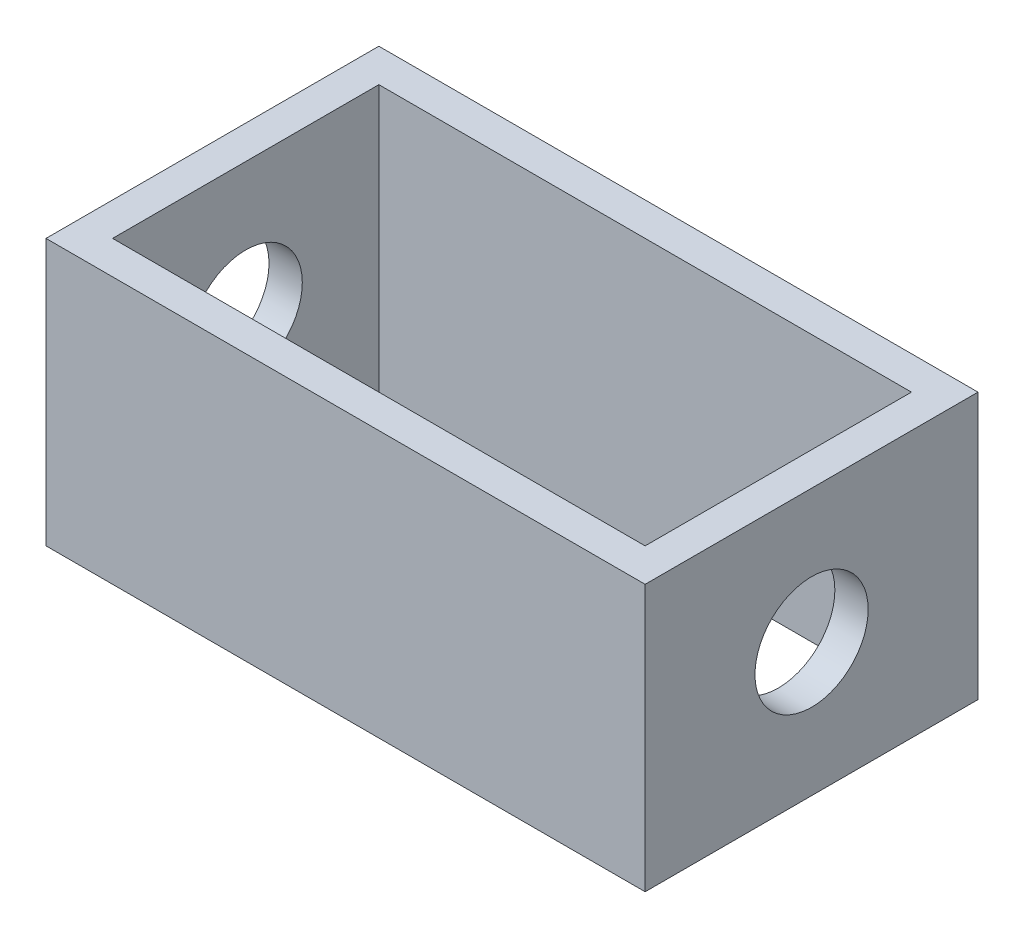
ISO-10303-21;
HEADER;
FILE_DESCRIPTION(('STEP AP214'),'2;1');
FILE_NAME('part.step','',(''),(''),'','','');
FILE_SCHEMA(('AUTOMOTIVE_DESIGN { 1 0 10303 214 1 1 1 1 }'));
ENDSEC;
DATA;
#1=APPLICATION_CONTEXT('core data for automotive mechanical design processes');
#2=APPLICATION_PROTOCOL_DEFINITION('international standard','automotive_design',2000,#1);
#3=PRODUCT_CONTEXT('',#1,'mechanical');
#4=PRODUCT('Part','Part','',(#3));
#5=PRODUCT_RELATED_PRODUCT_CATEGORY('part','',(#4));
#6=PRODUCT_DEFINITION_FORMATION('','',#4);
#7=PRODUCT_DEFINITION_CONTEXT('part definition',#1,'design');
#8=PRODUCT_DEFINITION('design','',#6,#7);
#9=PRODUCT_DEFINITION_SHAPE('','',#8);
#10=(LENGTH_UNIT() NAMED_UNIT(*) SI_UNIT(.MILLI.,.METRE.));
#11=(NAMED_UNIT(*) PLANE_ANGLE_UNIT() SI_UNIT($,.RADIAN.));
#12=(NAMED_UNIT(*) SI_UNIT($,.STERADIAN.) SOLID_ANGLE_UNIT());
#13=UNCERTAINTY_MEASURE_WITH_UNIT(LENGTH_MEASURE(1.E-05),#10,'distance_accuracy_value','');
#14=(GEOMETRIC_REPRESENTATION_CONTEXT(3) GLOBAL_UNCERTAINTY_ASSIGNED_CONTEXT((#13)) GLOBAL_UNIT_ASSIGNED_CONTEXT((#10,
#11,#12)) REPRESENTATION_CONTEXT('',''));
#15=CARTESIAN_POINT('',(0.,0.,0.));
#16=DIRECTION('',(0.,0.,1.));
#17=DIRECTION('',(1.,0.,0.));
#18=AXIS2_PLACEMENT_3D('',#15,#16,#17);
#19=CARTESIAN_POINT('',(0.,0.,0.));
#20=DIRECTION('',(0.,1.,0.));
#21=DIRECTION('',(0.,0.,1.));
#22=AXIS2_PLACEMENT_3D('',#19,#20,#21);
#23=PLANE('',#22);
#24=DIRECTION('',(0.,0.,1.));
#25=VECTOR('',#24,1.);
#26=CARTESIAN_POINT('',(-22.5,0.,12.5));
#27=LINE('',#26,#25);
#28=CARTESIAN_POINT('',(-22.5,0.,-12.5));
#29=VERTEX_POINT('',#28);
#30=CARTESIAN_POINT('',(-22.5,0.,12.5));
#31=VERTEX_POINT('',#30);
#32=EDGE_CURVE('E108',#29,#31,#27,.T.);
#33=ORIENTED_EDGE('',*,*,#32,.F.);
#34=DIRECTION('',(-1.,0.,0.));
#35=VECTOR('',#34,1.);
#36=CARTESIAN_POINT('',(22.5,0.,-12.5));
#37=LINE('',#36,#35);
#38=CARTESIAN_POINT('',(22.5,0.,-12.5));
#39=VERTEX_POINT('',#38);
#40=EDGE_CURVE('E57',#39,#29,#37,.T.);
#41=ORIENTED_EDGE('',*,*,#40,.F.);
#42=DIRECTION('',(0.,0.,-1.));
#43=VECTOR('',#42,1.);
#44=CARTESIAN_POINT('',(22.5,0.,12.5));
#45=LINE('',#44,#43);
#46=CARTESIAN_POINT('',(22.5,0.,12.5));
#47=VERTEX_POINT('',#46);
#48=EDGE_CURVE('E157',#47,#39,#45,.T.);
#49=ORIENTED_EDGE('',*,*,#48,.F.);
#50=DIRECTION('',(1.,0.,0.));
#51=VECTOR('',#50,1.);
#52=CARTESIAN_POINT('',(22.5,0.,12.5));
#53=LINE('',#52,#51);
#54=EDGE_CURVE('E155',#31,#47,#53,.T.);
#55=ORIENTED_EDGE('',*,*,#54,.F.);
#56=EDGE_LOOP('',(#33,#41,#49,#55));
#57=FACE_BOUND('',#56,.T.);
#58=DIRECTION('',(0.,0.,1.));
#59=VECTOR('',#58,1.);
#60=CARTESIAN_POINT('',(-20.,0.,10.));
#61=LINE('',#60,#59);
#62=CARTESIAN_POINT('',(-20.,0.,-10.));
#63=VERTEX_POINT('',#62);
#64=CARTESIAN_POINT('',(-20.,0.,10.));
#65=VERTEX_POINT('',#64);
#66=EDGE_CURVE('E49',#63,#65,#61,.T.);
#67=ORIENTED_EDGE('',*,*,#66,.T.);
#68=DIRECTION('',(1.,0.,0.));
#69=VECTOR('',#68,1.);
#70=CARTESIAN_POINT('',(20.,0.,10.));
#71=LINE('',#70,#69);
#72=CARTESIAN_POINT('',(20.,0.,10.));
#73=VERTEX_POINT('',#72);
#74=EDGE_CURVE('E107',#65,#73,#71,.T.);
#75=ORIENTED_EDGE('',*,*,#74,.T.);
#76=DIRECTION('',(0.,0.,-1.));
#77=VECTOR('',#76,1.);
#78=CARTESIAN_POINT('',(20.,0.,10.));
#79=LINE('',#78,#77);
#80=CARTESIAN_POINT('',(20.,0.,-10.));
#81=VERTEX_POINT('',#80);
#82=EDGE_CURVE('E143',#73,#81,#79,.T.);
#83=ORIENTED_EDGE('',*,*,#82,.T.);
#84=DIRECTION('',(-1.,0.,0.));
#85=VECTOR('',#84,1.);
#86=CARTESIAN_POINT('',(20.,0.,-10.));
#87=LINE('',#86,#85);
#88=EDGE_CURVE('E146',#81,#63,#87,.T.);
#89=ORIENTED_EDGE('',*,*,#88,.T.);
#90=EDGE_LOOP('',(#67,#75,#83,#89));
#91=FACE_BOUND('',#90,.T.);
#92=ADVANCED_FACE('F33',(#57,#91),#23,.F.);
#93=CARTESIAN_POINT('',(-22.5,2.5,12.5));
#94=DIRECTION('',(1.,0.,0.));
#95=DIRECTION('',(0.,0.,-1.));
#96=AXIS2_PLACEMENT_3D('',#93,#94,#95);
#97=PLANE('',#96);
#98=CARTESIAN_POINT('',(-22.5,10.,0.));
#99=DIRECTION('',(1.,0.,0.));
#100=DIRECTION('',(0.,0.,-1.));
#101=AXIS2_PLACEMENT_3D('',#98,#99,#100);
#102=CIRCLE('',#101,4.25);
#103=CARTESIAN_POINT('',(-22.5,10.,-4.25));
#104=VERTEX_POINT('',#103);
#105=EDGE_CURVE('E208',#104,#104,#102,.T.);
#106=ORIENTED_EDGE('',*,*,#105,.T.);
#107=EDGE_LOOP('',(#106));
#108=FACE_BOUND('',#107,.T.);
#109=ORIENTED_EDGE('',*,*,#32,.T.);
#110=DIRECTION('',(0.,-1.,0.));
#111=VECTOR('',#110,1.);
#112=CARTESIAN_POINT('',(-22.5,2.5,12.5));
#113=LINE('',#112,#111);
#114=CARTESIAN_POINT('',(-22.5,20.,12.5));
#115=VERTEX_POINT('',#114);
#116=EDGE_CURVE('E11',#115,#31,#113,.T.);
#117=ORIENTED_EDGE('',*,*,#116,.F.);
#118=DIRECTION('',(0.,0.,1.));
#119=VECTOR('',#118,1.);
#120=CARTESIAN_POINT('',(-22.5,20.,12.5));
#121=LINE('',#120,#119);
#122=CARTESIAN_POINT('',(-22.5,20.,-12.5));
#123=VERTEX_POINT('',#122);
#124=EDGE_CURVE('E129',#123,#115,#121,.T.);
#125=ORIENTED_EDGE('',*,*,#124,.F.);
#126=DIRECTION('',(0.,-1.,0.));
#127=VECTOR('',#126,1.);
#128=CARTESIAN_POINT('',(-22.5,2.5,-12.5));
#129=LINE('',#128,#127);
#130=EDGE_CURVE('E160',#123,#29,#129,.T.);
#131=ORIENTED_EDGE('',*,*,#130,.T.);
#132=EDGE_LOOP('',(#109,#117,#125,#131));
#133=FACE_BOUND('',#132,.T.);
#134=ADVANCED_FACE('F35',(#108,#133),#97,.F.);
#135=CARTESIAN_POINT('',(22.5,2.5,12.5));
#136=DIRECTION('',(0.,0.,-1.));
#137=DIRECTION('',(-1.,0.,0.));
#138=AXIS2_PLACEMENT_3D('',#135,#136,#137);
#139=PLANE('',#138);
#140=ORIENTED_EDGE('',*,*,#54,.T.);
#141=DIRECTION('',(0.,-1.,0.));
#142=VECTOR('',#141,1.);
#143=CARTESIAN_POINT('',(22.5,2.5,12.5));
#144=LINE('',#143,#142);
#145=CARTESIAN_POINT('',(22.5,20.,12.5));
#146=VERTEX_POINT('',#145);
#147=EDGE_CURVE('E42',#146,#47,#144,.T.);
#148=ORIENTED_EDGE('',*,*,#147,.F.);
#149=DIRECTION('',(1.,0.,0.));
#150=VECTOR('',#149,1.);
#151=CARTESIAN_POINT('',(22.5,20.,12.5));
#152=LINE('',#151,#150);
#153=EDGE_CURVE('E132',#115,#146,#152,.T.);
#154=ORIENTED_EDGE('',*,*,#153,.F.);
#155=ORIENTED_EDGE('',*,*,#116,.T.);
#156=EDGE_LOOP('',(#140,#148,#154,#155));
#157=FACE_BOUND('',#156,.T.);
#158=ADVANCED_FACE('F179',(#157),#139,.F.);
#159=CARTESIAN_POINT('',(22.5,2.5,12.5));
#160=DIRECTION('',(-1.,0.,0.));
#161=DIRECTION('',(0.,0.,1.));
#162=AXIS2_PLACEMENT_3D('',#159,#160,#161);
#163=PLANE('',#162);
#164=CARTESIAN_POINT('',(22.5,10.,0.));
#165=DIRECTION('',(1.,0.,0.));
#166=DIRECTION('',(0.,0.,-1.));
#167=AXIS2_PLACEMENT_3D('',#164,#165,#166);
#168=CIRCLE('',#167,4.25);
#169=CARTESIAN_POINT('',(22.5,10.,-4.25));
#170=VERTEX_POINT('',#169);
#171=EDGE_CURVE('E210',#170,#170,#168,.T.);
#172=ORIENTED_EDGE('',*,*,#171,.F.);
#173=EDGE_LOOP('',(#172));
#174=FACE_BOUND('',#173,.T.);
#175=ORIENTED_EDGE('',*,*,#48,.T.);
#176=DIRECTION('',(0.,-1.,0.));
#177=VECTOR('',#176,1.);
#178=CARTESIAN_POINT('',(22.5,2.5,-12.5));
#179=LINE('',#178,#177);
#180=CARTESIAN_POINT('',(22.5,20.,-12.5));
#181=VERTEX_POINT('',#180);
#182=EDGE_CURVE('E162',#181,#39,#179,.T.);
#183=ORIENTED_EDGE('',*,*,#182,.F.);
#184=DIRECTION('',(0.,0.,-1.));
#185=VECTOR('',#184,1.);
#186=CARTESIAN_POINT('',(22.5,20.,12.5));
#187=LINE('',#186,#185);
#188=EDGE_CURVE('E135',#146,#181,#187,.T.);
#189=ORIENTED_EDGE('',*,*,#188,.F.);
#190=ORIENTED_EDGE('',*,*,#147,.T.);
#191=EDGE_LOOP('',(#175,#183,#189,#190));
#192=FACE_BOUND('',#191,.T.);
#193=ADVANCED_FACE('F168',(#174,#192),#163,.F.);
#194=CARTESIAN_POINT('',(22.5,2.5,-12.5));
#195=DIRECTION('',(0.,0.,1.));
#196=DIRECTION('',(1.,0.,0.));
#197=AXIS2_PLACEMENT_3D('',#194,#195,#196);
#198=PLANE('',#197);
#199=ORIENTED_EDGE('',*,*,#40,.T.);
#200=ORIENTED_EDGE('',*,*,#130,.F.);
#201=DIRECTION('',(-1.,0.,0.));
#202=VECTOR('',#201,1.);
#203=CARTESIAN_POINT('',(22.5,20.,-12.5));
#204=LINE('',#203,#202);
#205=EDGE_CURVE('E138',#181,#123,#204,.T.);
#206=ORIENTED_EDGE('',*,*,#205,.F.);
#207=ORIENTED_EDGE('',*,*,#182,.T.);
#208=EDGE_LOOP('',(#199,#200,#206,#207));
#209=FACE_BOUND('',#208,.T.);
#210=ADVANCED_FACE('F177',(#209),#198,.F.);
#211=CARTESIAN_POINT('',(-20.,2.5,10.));
#212=DIRECTION('',(1.,0.,0.));
#213=DIRECTION('',(0.,0.,-1.));
#214=AXIS2_PLACEMENT_3D('',#211,#212,#213);
#215=PLANE('',#214);
#216=CARTESIAN_POINT('',(-20.,10.,0.));
#217=DIRECTION('',(1.,0.,0.));
#218=DIRECTION('',(0.,0.,-1.));
#219=AXIS2_PLACEMENT_3D('',#216,#217,#218);
#220=CIRCLE('',#219,4.25);
#221=CARTESIAN_POINT('',(-20.,10.,-4.25));
#222=VERTEX_POINT('',#221);
#223=EDGE_CURVE('E118',#222,#222,#220,.T.);
#224=ORIENTED_EDGE('',*,*,#223,.F.);
#225=EDGE_LOOP('',(#224));
#226=FACE_BOUND('',#225,.T.);
#227=ORIENTED_EDGE('',*,*,#66,.F.);
#228=DIRECTION('',(0.,-1.,0.));
#229=VECTOR('',#228,1.);
#230=CARTESIAN_POINT('',(-20.,2.5,-10.));
#231=LINE('',#230,#229);
#232=CARTESIAN_POINT('',(-20.,20.,-10.));
#233=VERTEX_POINT('',#232);
#234=EDGE_CURVE('E114',#233,#63,#231,.T.);
#235=ORIENTED_EDGE('',*,*,#234,.F.);
#236=DIRECTION('',(0.,0.,1.));
#237=VECTOR('',#236,1.);
#238=CARTESIAN_POINT('',(-20.,20.,10.));
#239=LINE('',#238,#237);
#240=CARTESIAN_POINT('',(-20.,20.,10.));
#241=VERTEX_POINT('',#240);
#242=EDGE_CURVE('E112',#233,#241,#239,.T.);
#243=ORIENTED_EDGE('',*,*,#242,.T.);
#244=DIRECTION('',(0.,-1.,0.));
#245=VECTOR('',#244,1.);
#246=CARTESIAN_POINT('',(-20.,2.5,10.));
#247=LINE('',#246,#245);
#248=EDGE_CURVE('E100',#241,#65,#247,.T.);
#249=ORIENTED_EDGE('',*,*,#248,.T.);
#250=EDGE_LOOP('',(#227,#235,#243,#249));
#251=FACE_BOUND('',#250,.T.);
#252=ADVANCED_FACE('F113',(#226,#251),#215,.T.);
#253=CARTESIAN_POINT('',(20.,2.5,10.));
#254=DIRECTION('',(0.,0.,-1.));
#255=DIRECTION('',(-1.,0.,0.));
#256=AXIS2_PLACEMENT_3D('',#253,#254,#255);
#257=PLANE('',#256);
#258=ORIENTED_EDGE('',*,*,#74,.F.);
#259=ORIENTED_EDGE('',*,*,#248,.F.);
#260=DIRECTION('',(1.,0.,0.));
#261=VECTOR('',#260,1.);
#262=CARTESIAN_POINT('',(20.,20.,10.));
#263=LINE('',#262,#261);
#264=CARTESIAN_POINT('',(20.,20.,10.));
#265=VERTEX_POINT('',#264);
#266=EDGE_CURVE('E104',#241,#265,#263,.T.);
#267=ORIENTED_EDGE('',*,*,#266,.T.);
#268=DIRECTION('',(0.,-1.,0.));
#269=VECTOR('',#268,1.);
#270=CARTESIAN_POINT('',(20.,2.5,10.));
#271=LINE('',#270,#269);
#272=EDGE_CURVE('E109',#265,#73,#271,.T.);
#273=ORIENTED_EDGE('',*,*,#272,.T.);
#274=EDGE_LOOP('',(#258,#259,#267,#273));
#275=FACE_BOUND('',#274,.T.);
#276=ADVANCED_FACE('F102',(#275),#257,.T.);
#277=CARTESIAN_POINT('',(20.,2.5,10.));
#278=DIRECTION('',(-1.,0.,0.));
#279=DIRECTION('',(0.,0.,1.));
#280=AXIS2_PLACEMENT_3D('',#277,#278,#279);
#281=PLANE('',#280);
#282=CARTESIAN_POINT('',(20.,10.,0.));
#283=DIRECTION('',(-1.,0.,0.));
#284=DIRECTION('',(0.,0.,1.));
#285=AXIS2_PLACEMENT_3D('',#282,#283,#284);
#286=CIRCLE('',#285,4.25);
#287=CARTESIAN_POINT('',(20.,10.,4.25));
#288=VERTEX_POINT('',#287);
#289=EDGE_CURVE('E37',#288,#288,#286,.T.);
#290=ORIENTED_EDGE('',*,*,#289,.F.);
#291=EDGE_LOOP('',(#290));
#292=FACE_BOUND('',#291,.T.);
#293=ORIENTED_EDGE('',*,*,#82,.F.);
#294=ORIENTED_EDGE('',*,*,#272,.F.);
#295=DIRECTION('',(0.,0.,-1.));
#296=VECTOR('',#295,1.);
#297=CARTESIAN_POINT('',(20.,20.,10.));
#298=LINE('',#297,#296);
#299=CARTESIAN_POINT('',(20.,20.,-10.));
#300=VERTEX_POINT('',#299);
#301=EDGE_CURVE('E122',#265,#300,#298,.T.);
#302=ORIENTED_EDGE('',*,*,#301,.T.);
#303=DIRECTION('',(0.,-1.,0.));
#304=VECTOR('',#303,1.);
#305=CARTESIAN_POINT('',(20.,2.5,-10.));
#306=LINE('',#305,#304);
#307=EDGE_CURVE('E150',#300,#81,#306,.T.);
#308=ORIENTED_EDGE('',*,*,#307,.T.);
#309=EDGE_LOOP('',(#293,#294,#302,#308));
#310=FACE_BOUND('',#309,.T.);
#311=ADVANCED_FACE('F203',(#292,#310),#281,.T.);
#312=CARTESIAN_POINT('',(20.,2.5,-10.));
#313=DIRECTION('',(0.,0.,1.));
#314=DIRECTION('',(1.,0.,0.));
#315=AXIS2_PLACEMENT_3D('',#312,#313,#314);
#316=PLANE('',#315);
#317=ORIENTED_EDGE('',*,*,#88,.F.);
#318=ORIENTED_EDGE('',*,*,#307,.F.);
#319=DIRECTION('',(-1.,0.,0.));
#320=VECTOR('',#319,1.);
#321=CARTESIAN_POINT('',(20.,20.,-10.));
#322=LINE('',#321,#320);
#323=EDGE_CURVE('E124',#300,#233,#322,.T.);
#324=ORIENTED_EDGE('',*,*,#323,.T.);
#325=ORIENTED_EDGE('',*,*,#234,.T.);
#326=EDGE_LOOP('',(#317,#318,#324,#325));
#327=FACE_BOUND('',#326,.T.);
#328=ADVANCED_FACE('F227',(#327),#316,.T.);
#329=CARTESIAN_POINT('',(0.,20.,0.));
#330=DIRECTION('',(0.,1.,0.));
#331=DIRECTION('',(0.,0.,1.));
#332=AXIS2_PLACEMENT_3D('',#329,#330,#331);
#333=PLANE('',#332);
#334=ORIENTED_EDGE('',*,*,#124,.T.);
#335=ORIENTED_EDGE('',*,*,#153,.T.);
#336=ORIENTED_EDGE('',*,*,#188,.T.);
#337=ORIENTED_EDGE('',*,*,#205,.T.);
#338=EDGE_LOOP('',(#334,#335,#336,#337));
#339=FACE_BOUND('',#338,.T.);
#340=ORIENTED_EDGE('',*,*,#266,.F.);
#341=ORIENTED_EDGE('',*,*,#242,.F.);
#342=ORIENTED_EDGE('',*,*,#323,.F.);
#343=ORIENTED_EDGE('',*,*,#301,.F.);
#344=EDGE_LOOP('',(#340,#341,#342,#343));
#345=FACE_BOUND('',#344,.T.);
#346=ADVANCED_FACE('F120',(#339,#345),#333,.T.);
#347=CARTESIAN_POINT('',(-22.5,10.,0.));
#348=DIRECTION('',(1.,0.,0.));
#349=DIRECTION('',(0.,0.,-1.));
#350=AXIS2_PLACEMENT_3D('',#347,#348,#349);
#351=CYLINDRICAL_SURFACE('',#350,4.25);
#352=ORIENTED_EDGE('',*,*,#289,.T.);
#353=EDGE_LOOP('',(#352));
#354=FACE_BOUND('',#353,.T.);
#355=ORIENTED_EDGE('',*,*,#171,.T.);
#356=EDGE_LOOP('',(#355));
#357=FACE_BOUND('',#356,.T.);
#358=ADVANCED_FACE('F218',(#354,#357),#351,.F.);
#359=ORIENTED_EDGE('',*,*,#223,.T.);
#360=EDGE_LOOP('',(#359));
#361=FACE_BOUND('',#360,.T.);
#362=ORIENTED_EDGE('',*,*,#105,.F.);
#363=EDGE_LOOP('',(#362));
#364=FACE_BOUND('',#363,.T.);
#365=ADVANCED_FACE('F216',(#361,#364),#351,.F.);
#366=CLOSED_SHELL('',(#92,#134,#158,#193,#210,#252,#276,#311,#328,#346,#358,#365));
#367=MANIFOLD_SOLID_BREP('B2',#366);
#368=ADVANCED_BREP_SHAPE_REPRESENTATION('',(#18,#367),#14);
#369=SHAPE_DEFINITION_REPRESENTATION(#9,#368);
ENDSEC;
END-ISO-10303-21;
